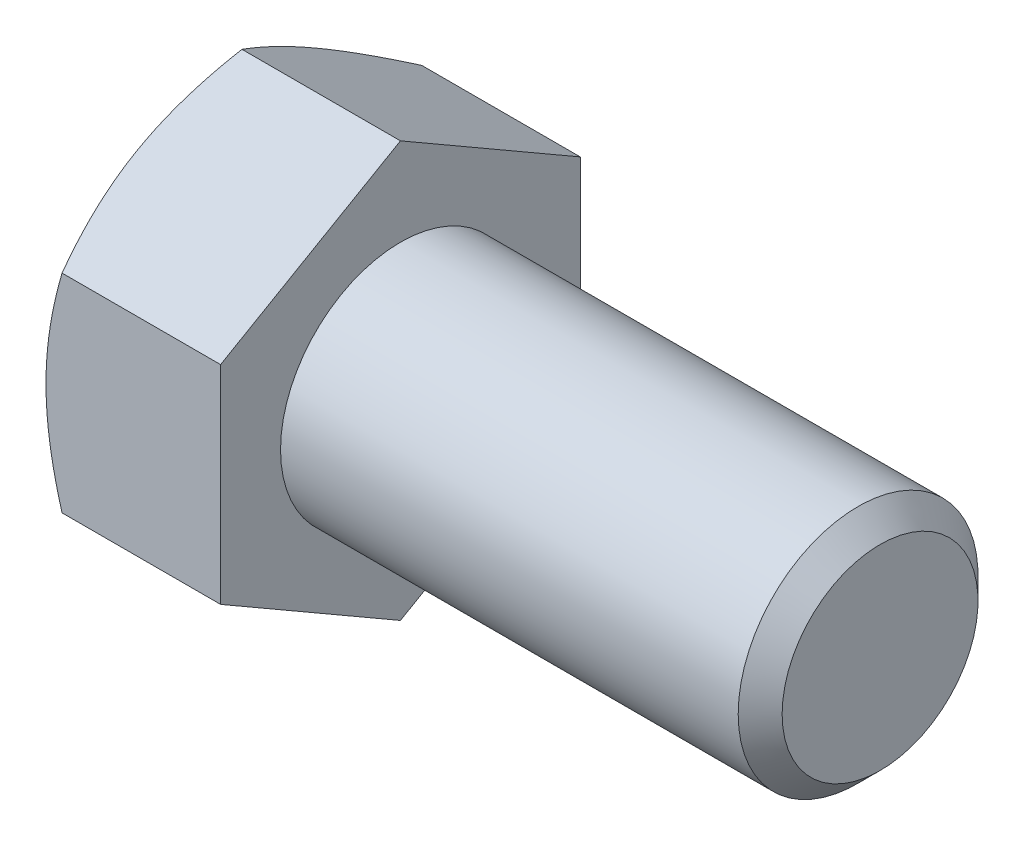
ISO-10303-21;
HEADER;
FILE_DESCRIPTION(('STEP AP214'),'2;1');
FILE_NAME('part.step','',(''),(''),'','','');
FILE_SCHEMA(('AUTOMOTIVE_DESIGN { 1 0 10303 214 1 1 1 1 }'));
ENDSEC;
DATA;
#1=APPLICATION_CONTEXT('core data for automotive mechanical design processes');
#2=APPLICATION_PROTOCOL_DEFINITION('international standard','automotive_design',2000,#1);
#3=PRODUCT_CONTEXT('',#1,'mechanical');
#4=PRODUCT('Part','Part','',(#3));
#5=PRODUCT_RELATED_PRODUCT_CATEGORY('part','',(#4));
#6=PRODUCT_DEFINITION_FORMATION('','',#4);
#7=PRODUCT_DEFINITION_CONTEXT('part definition',#1,'design');
#8=PRODUCT_DEFINITION('design','',#6,#7);
#9=PRODUCT_DEFINITION_SHAPE('','',#8);
#10=(LENGTH_UNIT() NAMED_UNIT(*) SI_UNIT(.MILLI.,.METRE.));
#11=(NAMED_UNIT(*) PLANE_ANGLE_UNIT() SI_UNIT($,.RADIAN.));
#12=(NAMED_UNIT(*) SI_UNIT($,.STERADIAN.) SOLID_ANGLE_UNIT());
#13=UNCERTAINTY_MEASURE_WITH_UNIT(LENGTH_MEASURE(1.E-05),#10,'distance_accuracy_value','');
#14=(GEOMETRIC_REPRESENTATION_CONTEXT(3) GLOBAL_UNCERTAINTY_ASSIGNED_CONTEXT((#13)) GLOBAL_UNIT_ASSIGNED_CONTEXT((#10,
#11,#12)) REPRESENTATION_CONTEXT('',''));
#15=CARTESIAN_POINT('',(0.,0.,0.));
#16=DIRECTION('',(0.,0.,1.));
#17=DIRECTION('',(1.,0.,0.));
#18=AXIS2_PLACEMENT_3D('',#15,#16,#17);
#19=CARTESIAN_POINT('',(9.2456,5.49926131403118,-9.525));
#20=DIRECTION('',(0.,-0.866025403784438,0.5));
#21=DIRECTION('',(0.,-0.5,-0.866025403784438));
#22=AXIS2_PLACEMENT_3D('',#19,#20,#21);
#23=PLANE('',#22);
#24=CARTESIAN_POINT('',(0.850805353685338,10.9986380981162,0.0002));
#25=CARTESIAN_POINT('',(0.781023201247653,10.8777523132173,-0.209180321357812));
#26=CARTESIAN_POINT('',(0.714408233957874,10.7564158029679,-0.419341321922841));
#27=CARTESIAN_POINT('',(0.588391469790024,10.5127697532954,-0.841348659019071));
#28=CARTESIAN_POINT('',(0.528992045309774,10.3904599078574,-1.05319552558363));
#29=CARTESIAN_POINT('',(0.362766604707593,10.0215595864394,-1.69214962520807));
#30=CARTESIAN_POINT('',(0.268218329918823,9.77351282584137,-2.12177921721668));
#31=CARTESIAN_POINT('',(0.15735162884543,9.40232220358294,-2.76470023426138));
#32=CARTESIAN_POINT('',(0.125769866148953,9.28028730086356,-2.97607088606807));
#33=CARTESIAN_POINT('',(0.0728092531292027,9.03565248016183,-3.39979082482396));
#34=CARTESIAN_POINT('',(0.0514305991810305,8.91305255135051,-3.61214013052951));
#35=CARTESIAN_POINT('',(0.0194239766724795,8.66764818787802,-4.03719295646296));
#36=CARTESIAN_POINT('',(0.00878323258549875,8.54484417077186,-4.24989575346439));
#37=CARTESIAN_POINT('',(-0.00152146504907752,8.29912270270345,-4.67549782066928));
#38=CARTESIAN_POINT('',(-0.00118575773535298,8.17620525536319,-4.88839708459929));
#39=CARTESIAN_POINT('',(0.00969884023177671,7.9464080768915,-5.28641747314822));
#40=CARTESIAN_POINT('',(0.0189199445075641,7.83951212670956,-5.4715666899867));
#41=CARTESIAN_POINT('',(0.0454848010115628,7.62597023317657,-5.84143209913029));
#42=CARTESIAN_POINT('',(0.0628291278252528,7.5193243080471,-6.02614825987472));
#43=CARTESIAN_POINT('',(0.126636878025749,7.19979976097279,-6.57958100967286));
#44=CARTESIAN_POINT('',(0.184867121471558,6.98748672019118,-6.94731798341605));
#45=CARTESIAN_POINT('',(0.330443291970776,6.56060850831896,-7.68669273502289));
#46=CARTESIAN_POINT('',(0.418406296346452,6.3460978161353,-8.05823615265175));
#47=CARTESIAN_POINT('',(0.618045797355989,5.92027529884848,-8.79578238759941));
#48=CARTESIAN_POINT('',(0.729675405460148,5.70895802095901,-9.16179464942111));
#49=CARTESIAN_POINT('',(0.85080535368533,5.49914584397734,-9.5252));
#50=B_SPLINE_CURVE_WITH_KNOTS('',3,(#24,#25,#26,#27,#28,#29,#30,#31,#32,#33,#34,#35,#36,#37,#38,
#39,#40,#41,#42,#43,#44,#45,#46,#47,#48,#49),.UNSPECIFIED.,.F.,.F.,(4,2,2,2,2,2,2,2,2,2,2,2,4),
(0.,0.754861746958003,1.50997101692212,3.02340406075151,3.76154608748043,4.49970232035707,
5.23697928598073,5.97423347202914,6.61604550518408,7.25790294292824,8.54252993638602,
9.85564695316764,11.1661863217647),.UNSPECIFIED.);
#51=CARTESIAN_POINT('',(0.850738685968814,10.9985226280624,0.));
#52=VERTEX_POINT('',#51);
#53=CARTESIAN_POINT('',(0.,8.24889197104677,-4.7625));
#54=VERTEX_POINT('',#53);
#55=EDGE_CURVE('E32',#52,#54,#50,.T.);
#56=ORIENTED_EDGE('',*,*,#55,.F.);
#57=DIRECTION('',(-1.,0.,0.));
#58=VECTOR('',#57,1.);
#59=CARTESIAN_POINT('',(9.2456,10.9985226280624,0.));
#60=LINE('',#59,#58);
#61=CARTESIAN_POINT('',(9.2456,10.9985226280624,0.));
#62=VERTEX_POINT('',#61);
#63=EDGE_CURVE('E128',#62,#52,#60,.T.);
#64=ORIENTED_EDGE('',*,*,#63,.F.);
#65=DIRECTION('',(0.,0.5,0.866025403784438));
#66=VECTOR('',#65,1.);
#67=CARTESIAN_POINT('',(9.2456,5.49926131403118,-9.525));
#68=LINE('',#67,#66);
#69=CARTESIAN_POINT('',(9.2456,5.49926131403118,-9.525));
#70=VERTEX_POINT('',#69);
#71=EDGE_CURVE('E213',#70,#62,#68,.T.);
#72=ORIENTED_EDGE('',*,*,#71,.F.);
#73=DIRECTION('',(-1.,0.,0.));
#74=VECTOR('',#73,1.);
#75=CARTESIAN_POINT('',(9.2456,5.49926131403118,-9.525));
#76=LINE('',#75,#74);
#77=CARTESIAN_POINT('',(0.850738685968807,5.49926131403118,-9.525));
#78=VERTEX_POINT('',#77);
#79=EDGE_CURVE('E116',#70,#78,#76,.T.);
#80=ORIENTED_EDGE('',*,*,#79,.T.);
#81=EDGE_CURVE('E110',#54,#78,#50,.T.);
#82=ORIENTED_EDGE('',*,*,#81,.F.);
#83=EDGE_LOOP('',(#56,#64,#72,#80,#82));
#84=FACE_BOUND('',#83,.T.);
#85=ADVANCED_FACE('F16',(#84),#23,.F.);
#86=CARTESIAN_POINT('',(9.2456,10.9985226280624,0.));
#87=DIRECTION('',(0.,-0.866025403784438,-0.5));
#88=DIRECTION('',(0.,0.5,-0.866025403784438));
#89=AXIS2_PLACEMENT_3D('',#86,#87,#88);
#90=PLANE('',#89);
#91=CARTESIAN_POINT('',(0.850805353685331,5.49914584397734,9.5252));
#92=CARTESIAN_POINT('',(0.781023201247651,5.62003162887629,9.31581967864219));
#93=CARTESIAN_POINT('',(0.714408233957875,5.74136813912568,9.10565867807716));
#94=CARTESIAN_POINT('',(0.588391469790027,5.98501418879818,8.68365134098093));
#95=CARTESIAN_POINT('',(0.528992045309778,6.10732403423621,8.47180447441637));
#96=CARTESIAN_POINT('',(0.362766604707597,6.47622435565419,7.83285037479193));
#97=CARTESIAN_POINT('',(0.268218329918826,6.72427111625219,7.40322078278333));
#98=CARTESIAN_POINT('',(0.157351628845434,7.09546173851062,6.76029976573862));
#99=CARTESIAN_POINT('',(0.125769866148958,7.21749664123,6.54892911393194));
#100=CARTESIAN_POINT('',(0.0728092531292075,7.46213146193172,6.12520917517604));
#101=CARTESIAN_POINT('',(0.0514305991810352,7.58473139074305,5.91285986947049));
#102=CARTESIAN_POINT('',(0.0194239766724854,7.83013575421554,5.48780704353704));
#103=CARTESIAN_POINT('',(0.00878323258550612,7.9529397713217,5.27510424653562));
#104=CARTESIAN_POINT('',(-0.00152146504907289,8.1986612393901,4.84950217933073));
#105=CARTESIAN_POINT('',(-0.00118575773535251,8.32157868673037,4.63660291540072));
#106=CARTESIAN_POINT('',(0.00969884023177773,8.55137586520205,4.23858252685179));
#107=CARTESIAN_POINT('',(0.0189199445075688,8.658271815384,4.05343331001331));
#108=CARTESIAN_POINT('',(0.0454848010115698,8.87181370891698,3.68356790086972));
#109=CARTESIAN_POINT('',(0.0628291278252584,8.97845963404645,3.49885174012529));
#110=CARTESIAN_POINT('',(0.126636878025752,9.29798418112076,2.94541899032714));
#111=CARTESIAN_POINT('',(0.184867121471563,9.51029722190237,2.57768201658396));
#112=CARTESIAN_POINT('',(0.330443291970782,9.93717543377459,1.83830726497712));
#113=CARTESIAN_POINT('',(0.418406296346458,10.1516861259583,1.46676384734825));
#114=CARTESIAN_POINT('',(0.618045797355995,10.5775086432451,0.729217612400589));
#115=CARTESIAN_POINT('',(0.729675405460155,10.7888259211345,0.363205350578887));
#116=CARTESIAN_POINT('',(0.850805353685338,10.9986380981162,-0.000199999999998291));
#117=B_SPLINE_CURVE_WITH_KNOTS('',3,(#91,#92,#93,#94,#95,#96,#97,#98,#99,#100,#101,#102,#103,
#104,#105,#106,#107,#108,#109,#110,#111,#112,#113,#114,#115,#116),.UNSPECIFIED.,.F.,.F.,(4,2,2,
2,2,2,2,2,2,2,2,2,4),(0.,0.754861746958003,1.50997101692211,3.0234040607515,3.76154608748042,
4.49970232035706,5.23697928598071,5.97423347202912,6.61604550518407,7.25790294292823,
8.54252993638601,9.85564695316763,11.1661863217647),.UNSPECIFIED.);
#118=CARTESIAN_POINT('',(0.850738685968807,5.49926131403118,9.525));
#119=VERTEX_POINT('',#118);
#120=CARTESIAN_POINT('',(0.,8.24889197104677,4.7625));
#121=VERTEX_POINT('',#120);
#122=EDGE_CURVE('E39',#119,#121,#117,.T.);
#123=ORIENTED_EDGE('',*,*,#122,.F.);
#124=DIRECTION('',(-1.,0.,0.));
#125=VECTOR('',#124,1.);
#126=CARTESIAN_POINT('',(9.2456,5.49926131403118,9.525));
#127=LINE('',#126,#125);
#128=CARTESIAN_POINT('',(9.2456,5.49926131403118,9.525));
#129=VERTEX_POINT('',#128);
#130=EDGE_CURVE('E126',#129,#119,#127,.T.);
#131=ORIENTED_EDGE('',*,*,#130,.F.);
#132=DIRECTION('',(0.,-0.5,0.866025403784438));
#133=VECTOR('',#132,1.);
#134=CARTESIAN_POINT('',(9.2456,10.9985226280624,0.));
#135=LINE('',#134,#133);
#136=EDGE_CURVE('E211',#62,#129,#135,.T.);
#137=ORIENTED_EDGE('',*,*,#136,.F.);
#138=ORIENTED_EDGE('',*,*,#63,.T.);
#139=EDGE_CURVE('E143',#121,#52,#117,.T.);
#140=ORIENTED_EDGE('',*,*,#139,.F.);
#141=EDGE_LOOP('',(#123,#131,#137,#138,#140));
#142=FACE_BOUND('',#141,.T.);
#143=ADVANCED_FACE('F149',(#142),#90,.F.);
#144=CARTESIAN_POINT('',(9.2456,5.49926131403118,9.525));
#145=DIRECTION('',(0.,0.,-1.));
#146=DIRECTION('',(-1.,0.,0.));
#147=AXIS2_PLACEMENT_3D('',#144,#145,#146);
#148=PLANE('',#147);
#149=CARTESIAN_POINT('',(4.65297862020098,-14.7810115366526,9.525));
#150=CARTESIAN_POINT('',(4.55200114697973,-14.5729402848548,9.525));
#151=CARTESIAN_POINT('',(4.45152657852498,-14.3646250845142,9.525));
#152=CARTESIAN_POINT('',(4.25169715270383,-13.9474558848885,9.525));
#153=CARTESIAN_POINT('',(4.15234230655457,-13.7386018802315,9.525));
#154=CARTESIAN_POINT('',(3.85610205085235,-13.1110997604408,9.525));
#155=CARTESIAN_POINT('',(3.6610708294632,-12.6915729928092,9.525));
#156=CARTESIAN_POINT('',(3.27608312845874,-11.8474364819289,9.525));
#157=CARTESIAN_POINT('',(3.0861599652033,-11.422811507093,9.525));
#158=CARTESIAN_POINT('',(2.71407238167632,-10.5701875182868,9.525));
#159=CARTESIAN_POINT('',(2.53190759510787,-10.1421886647408,9.525));
#160=CARTESIAN_POINT('',(2.17173180421228,-9.26840827793759,9.525));
#161=CARTESIAN_POINT('',(1.99403865760541,-8.82249500065036,9.525));
#162=CARTESIAN_POINT('',(1.65207801715252,-7.92545654404826,9.525));
#163=CARTESIAN_POINT('',(1.48781202814776,-7.47433078699664,9.525));
#164=CARTESIAN_POINT('',(1.17701101312694,-6.56698486643259,9.525));
#165=CARTESIAN_POINT('',(1.03044020737989,-6.11077709183231,9.525));
#166=CARTESIAN_POINT('',(0.75972398046239,-5.19183461770943,9.525));
#167=CARTESIAN_POINT('',(0.635571508908759,-4.72910201971932,9.525));
#168=CARTESIAN_POINT('',(0.416296039044819,-3.79927533749822,9.525));
#169=CARTESIAN_POINT('',(0.321019170056992,-3.33221854628566,9.525));
#170=CARTESIAN_POINT('',(0.203895327456017,-2.62737339603031,9.525));
#171=CARTESIAN_POINT('',(0.169151073901591,-2.3916981506508,9.525));
#172=CARTESIAN_POINT('',(0.108940898325766,-1.9191730535318,9.525));
#173=CARTESIAN_POINT('',(0.0834740799106693,-1.68232331751523,9.525));
#174=CARTESIAN_POINT('',(0.0426462139382896,-1.21086692666169,9.525));
#175=CARTESIAN_POINT('',(0.0271575476697075,-0.976271367216066,9.525));
#176=CARTESIAN_POINT('',(0.00611497588533384,-0.50663550847792,9.525));
#177=CARTESIAN_POINT('',(0.000560905150695089,-0.271595216646667,9.525));
#178=CARTESIAN_POINT('',(-0.00047996713179102,0.198511625361359,9.525));
#179=CARTESIAN_POINT('',(0.00403333600034632,0.433578175785753,9.525));
#180=CARTESIAN_POINT('',(0.0230169602197971,0.903311845567794,9.525));
#181=CARTESIAN_POINT('',(0.0374877771856497,1.13797894444952,9.525));
#182=CARTESIAN_POINT('',(0.0838926002328727,1.70156520102244,9.525));
#183=CARTESIAN_POINT('',(0.120529196491433,2.03010533257165,9.525));
#184=CARTESIAN_POINT('',(0.211324091565233,2.68473880457709,9.525));
#185=CARTESIAN_POINT('',(0.265484757377362,3.01083180840532,9.525));
#186=CARTESIAN_POINT('',(0.451380100896858,3.98506326209965,9.525));
#187=CARTESIAN_POINT('',(0.606495020219109,4.62879899939557,9.525));
#188=CARTESIAN_POINT('',(0.875429330956885,5.59158230732317,9.525));
#189=CARTESIAN_POINT('',(0.97240525405904,5.91562142468822,9.525));
#190=CARTESIAN_POINT('',(1.17640873934351,6.56055109397586,9.525));
#191=CARTESIAN_POINT('',(1.28343637307409,6.88144162346878,9.525));
#192=CARTESIAN_POINT('',(1.50582732440543,7.52017825999877,9.525));
#193=CARTESIAN_POINT('',(1.62118794476216,7.8380253147631,9.525));
#194=CARTESIAN_POINT('',(1.85888923263681,8.47108431720183,9.525));
#195=CARTESIAN_POINT('',(1.98122977973554,8.78629631022937,9.525));
#196=CARTESIAN_POINT('',(2.3006347745931,9.58716274310344,9.525));
#197=CARTESIAN_POINT('',(2.50178184900061,10.0711868007297,9.525));
#198=CARTESIAN_POINT('',(2.91473175900995,11.0346830906918,9.525));
#199=CARTESIAN_POINT('',(3.12653548923493,11.514154936841,9.525));
#200=CARTESIAN_POINT('',(3.55844219486129,12.4695072075479,9.525));
#201=CARTESIAN_POINT('',(3.77854763045355,12.9453865165195,9.525));
#202=CARTESIAN_POINT('',(4.22520690131801,13.8940827737157,9.525));
#203=CARTESIAN_POINT('',(4.45176054207864,14.3668998137873,9.525));
#204=CARTESIAN_POINT('',(4.91030379081789,15.31066754278,9.525));
#205=CARTESIAN_POINT('',(5.14230026383007,15.7816148898186,9.525));
#206=CARTESIAN_POINT('',(5.61043419198852,16.7214473380242,9.525));
#207=CARTESIAN_POINT('',(5.84657167244609,17.190332426564,9.525));
#208=CARTESIAN_POINT('',(6.32217781208355,18.1263065899709,9.525));
#209=CARTESIAN_POINT('',(6.56164589066585,18.5933959601917,9.525));
#210=CARTESIAN_POINT('',(7.04336394052912,19.5261387749102,9.525));
#211=CARTESIAN_POINT('',(7.2856139225859,19.9917922138368,9.525));
#212=CARTESIAN_POINT('',(7.96929589667508,21.2980525732429,9.525));
#213=CARTESIAN_POINT('',(8.41334550528857,22.137289288128,9.525));
#214=CARTESIAN_POINT('',(9.30698696570738,23.81285124024,9.525));
#215=CARTESIAN_POINT('',(9.75657908064913,24.6491763367986,9.525));
#216=CARTESIAN_POINT('',(10.6586387715906,26.3171534675353,9.525));
#217=CARTESIAN_POINT('',(11.1110942984919,27.1488120222569,9.525));
#218=CARTESIAN_POINT('',(11.7921739160347,28.394953533384,9.525));
#219=CARTESIAN_POINT('',(12.0195924712892,28.8100962856008,9.525));
#220=CARTESIAN_POINT('',(12.4751463020887,29.6399876727052,9.525));
#221=CARTESIAN_POINT('',(12.7032815766791,30.0547363081167,9.525));
#222=CARTESIAN_POINT('',(12.9317320980144,30.4693112732241,9.525));
#223=B_SPLINE_CURVE_WITH_KNOTS('',3,(#149,#150,#151,#152,#153,#154,#155,#156,#157,#158,#159,
#160,#161,#162,#163,#164,#165,#166,#167,#168,#169,#170,#171,#172,#173,#174,#175,#176,#177,#178,
#179,#180,#181,#182,#183,#184,#185,#186,#187,#188,#189,#190,#191,#192,#193,#194,#195,#196,#197,
#198,#199,#200,#201,#202,#203,#204,#205,#206,#207,#208,#209,#210,#211,#212,#213,#214,#215,#216,
#217,#218,#219,#220,#221,#222),.UNSPECIFIED.,.F.,.F.,(4,2,2,2,2,2,2,2,2,2,2,2,2,2,2,2,2,2,2,2,2,
2,2,2,2,2,2,2,2,2,2,2,2,2,2,2,4),(0.,0.693836530044209,1.38768000463458,2.77557197297935,
4.17100213114403,5.56636633354267,7.00624082823087,8.44627647542748,9.88334978435084,
11.3199703553044,12.748795200913,13.4633089947651,14.1777537333629,14.882869257303,
15.5879730545998,16.2930841835603,16.9982304291963,17.9894005549206,18.9807046150987,
20.9643780182785,21.979010564481,22.9936503334043,24.0079631400216,25.0222584527869,
26.5945433127102,28.1669603864418,29.7398471611297,31.3126865395143,32.8876294963395,
34.4625820831342,36.0372634785706,37.6119509756548,40.4603369594249,43.3088586981741,
46.1491565485713,47.569213896597,48.9892693539118),.UNSPECIFIED.);
#224=CARTESIAN_POINT('',(0.850738685968804,-5.49926131403117,9.525));
#225=VERTEX_POINT('',#224);
#226=CARTESIAN_POINT('',(0.,0.,9.525));
#227=VERTEX_POINT('',#226);
#228=EDGE_CURVE('E223',#225,#227,#223,.T.);
#229=ORIENTED_EDGE('',*,*,#228,.F.);
#230=DIRECTION('',(-1.,0.,0.));
#231=VECTOR('',#230,1.);
#232=CARTESIAN_POINT('',(9.2456,-5.49926131403117,9.525));
#233=LINE('',#232,#231);
#234=CARTESIAN_POINT('',(9.2456,-5.49926131403117,9.525));
#235=VERTEX_POINT('',#234);
#236=EDGE_CURVE('E118',#235,#225,#233,.T.);
#237=ORIENTED_EDGE('',*,*,#236,.F.);
#238=DIRECTION('',(0.,-1.,0.));
#239=VECTOR('',#238,1.);
#240=CARTESIAN_POINT('',(9.2456,5.49926131403118,9.525));
#241=LINE('',#240,#239);
#242=EDGE_CURVE('E207',#129,#235,#241,.T.);
#243=ORIENTED_EDGE('',*,*,#242,.F.);
#244=ORIENTED_EDGE('',*,*,#130,.T.);
#245=EDGE_CURVE('E165',#227,#119,#223,.T.);
#246=ORIENTED_EDGE('',*,*,#245,.F.);
#247=EDGE_LOOP('',(#229,#237,#243,#244,#246));
#248=FACE_BOUND('',#247,.T.);
#249=ADVANCED_FACE('F229',(#248),#148,.F.);
#250=CARTESIAN_POINT('',(9.2456,-10.9985226280624,0.));
#251=DIRECTION('',(0.,0.866025403784438,-0.5));
#252=DIRECTION('',(0.,0.5,0.866025403784438));
#253=AXIS2_PLACEMENT_3D('',#250,#251,#252);
#254=PLANE('',#253);
#255=CARTESIAN_POINT('',(0.85080535368534,-10.9986380981162,-0.000200000000000067));
#256=CARTESIAN_POINT('',(0.781023201247656,-10.8777523132173,0.209180321357816));
#257=CARTESIAN_POINT('',(0.714408233957879,-10.7564158029679,0.419341321922846));
#258=CARTESIAN_POINT('',(0.588391469790028,-10.5127697532954,0.841348659019076));
#259=CARTESIAN_POINT('',(0.528992045309778,-10.3904599078574,1.05319552558363));
#260=CARTESIAN_POINT('',(0.362766604707597,-10.0215595864394,1.69214962520808));
#261=CARTESIAN_POINT('',(0.268218329918828,-9.77351282584137,2.12177921721668));
#262=CARTESIAN_POINT('',(0.157351628845435,-9.40232220358295,2.76470023426139));
#263=CARTESIAN_POINT('',(0.125769866148958,-9.28028730086357,2.97607088606807));
#264=CARTESIAN_POINT('',(0.0728092531292075,-9.03565248016184,3.39979082482397));
#265=CARTESIAN_POINT('',(0.0514305991810347,-8.91305255135051,3.61214013052952));
#266=CARTESIAN_POINT('',(0.0194239766724846,-8.66764818787802,4.03719295646297));
#267=CARTESIAN_POINT('',(0.00878323258550548,-8.54484417077187,4.24989575346439));
#268=CARTESIAN_POINT('',(-0.00152146504907424,-8.29912270270346,4.67549782066929));
#269=CARTESIAN_POINT('',(-0.00118575773535478,-8.17620525536319,4.88839708459929));
#270=CARTESIAN_POINT('',(0.00969884023177595,-7.9464080768915,5.28641747314822));
#271=CARTESIAN_POINT('',(0.0189199445075681,-7.83951212670956,5.4715666899867));
#272=CARTESIAN_POINT('',(0.0454848010115702,-7.62597023317658,5.84143209913029));
#273=CARTESIAN_POINT('',(0.0628291278252588,-7.51932430804711,6.02614825987473));
#274=CARTESIAN_POINT('',(0.126636878025752,-7.19979976097279,6.57958100967287));
#275=CARTESIAN_POINT('',(0.184867121471563,-6.98748672019119,6.94731798341605));
#276=CARTESIAN_POINT('',(0.330443291970782,-6.56060850831897,7.6866927350229));
#277=CARTESIAN_POINT('',(0.418406296346458,-6.34609781613531,8.05823615265176));
#278=CARTESIAN_POINT('',(0.618045797355994,-5.92027529884848,8.79578238759942));
#279=CARTESIAN_POINT('',(0.729675405460152,-5.70895802095901,9.16179464942112));
#280=CARTESIAN_POINT('',(0.85080535368533,-5.49914584397733,9.5252));
#281=B_SPLINE_CURVE_WITH_KNOTS('',3,(#255,#256,#257,#258,#259,#260,#261,#262,#263,#264,#265,
#266,#267,#268,#269,#270,#271,#272,#273,#274,#275,#276,#277,#278,#279,#280),.UNSPECIFIED.,.F.,
.F.,(4,2,2,2,2,2,2,2,2,2,2,2,4),(0.,0.754861746958003,1.50997101692212,3.02340406075151,
3.76154608748043,4.49970232035707,5.23697928598072,5.97423347202913,6.61604550518408,
7.25790294292824,8.54252993638602,9.85564695316764,11.1661863217647),.UNSPECIFIED.);
#282=CARTESIAN_POINT('',(0.850738685968816,-10.9985226280624,0.));
#283=VERTEX_POINT('',#282);
#284=CARTESIAN_POINT('',(0.,-8.24889197104677,4.7625));
#285=VERTEX_POINT('',#284);
#286=EDGE_CURVE('E151',#283,#285,#281,.T.);
#287=ORIENTED_EDGE('',*,*,#286,.F.);
#288=DIRECTION('',(-1.,0.,0.));
#289=VECTOR('',#288,1.);
#290=CARTESIAN_POINT('',(9.2456,-10.9985226280624,0.));
#291=LINE('',#290,#289);
#292=CARTESIAN_POINT('',(9.2456,-10.9985226280624,0.));
#293=VERTEX_POINT('',#292);
#294=EDGE_CURVE('E115',#293,#283,#291,.T.);
#295=ORIENTED_EDGE('',*,*,#294,.F.);
#296=DIRECTION('',(0.,-0.5,-0.866025403784438));
#297=VECTOR('',#296,1.);
#298=CARTESIAN_POINT('',(9.2456,-10.9985226280624,0.));
#299=LINE('',#298,#297);
#300=EDGE_CURVE('E205',#235,#293,#299,.T.);
#301=ORIENTED_EDGE('',*,*,#300,.F.);
#302=ORIENTED_EDGE('',*,*,#236,.T.);
#303=EDGE_CURVE('E153',#285,#225,#281,.T.);
#304=ORIENTED_EDGE('',*,*,#303,.F.);
#305=EDGE_LOOP('',(#287,#295,#301,#302,#304));
#306=FACE_BOUND('',#305,.T.);
#307=ADVANCED_FACE('F201',(#306),#254,.F.);
#308=CARTESIAN_POINT('',(9.2456,-5.4992613140312,-9.525));
#309=DIRECTION('',(0.,0.866025403784439,0.5));
#310=DIRECTION('',(0.,-0.5,0.866025403784439));
#311=AXIS2_PLACEMENT_3D('',#308,#309,#310);
#312=PLANE('',#311);
#313=CARTESIAN_POINT('',(0.850805353685337,-5.49914584397736,-9.5252));
#314=CARTESIAN_POINT('',(0.781023201247655,-5.62003162887631,-9.31581967864218));
#315=CARTESIAN_POINT('',(0.714408233957878,-5.74136813912569,-9.10565867807715));
#316=CARTESIAN_POINT('',(0.588391469790028,-5.9850141887982,-8.68365134098092));
#317=CARTESIAN_POINT('',(0.528992045309778,-6.10732403423622,-8.47180447441636));
#318=CARTESIAN_POINT('',(0.362766604707597,-6.47622435565421,-7.83285037479192));
#319=CARTESIAN_POINT('',(0.268218329918828,-6.7242711162522,-7.40322078278332));
#320=CARTESIAN_POINT('',(0.157351628845436,-7.09546173851063,-6.76029976573861));
#321=CARTESIAN_POINT('',(0.12576986614896,-7.21749664123001,-6.54892911393193));
#322=CARTESIAN_POINT('',(0.0728092531292099,-7.46213146193174,-6.12520917517603));
#323=CARTESIAN_POINT('',(0.051430599181038,-7.58473139074307,-5.91285986947048));
#324=CARTESIAN_POINT('',(0.0194239766724879,-7.83013575421555,-5.48780704353703));
#325=CARTESIAN_POINT('',(0.00878323258550788,-7.95293977132171,-5.27510424653561));
#326=CARTESIAN_POINT('',(-0.00152146504906965,-8.19866123939012,-4.84950217933072));
#327=CARTESIAN_POINT('',(-0.00118575773534702,-8.32157868673039,-4.63660291540071));
#328=CARTESIAN_POINT('',(0.00969884023178369,-8.55137586520207,-4.23858252685178));
#329=CARTESIAN_POINT('',(0.0189199445075734,-8.65827181538401,-4.0534333100133));
#330=CARTESIAN_POINT('',(0.0454848010115735,-8.87181370891699,-3.68356790086971));
#331=CARTESIAN_POINT('',(0.0628291278252626,-8.97845963404647,-3.49885174012527));
#332=CARTESIAN_POINT('',(0.126636878025757,-9.29798418112078,-2.94541899032714));
#333=CARTESIAN_POINT('',(0.184867121471567,-9.51029722190238,-2.57768201658395));
#334=CARTESIAN_POINT('',(0.330443291970785,-9.9371754337746,-1.83830726497711));
#335=CARTESIAN_POINT('',(0.418406296346461,-10.1516861259583,-1.46676384734824));
#336=CARTESIAN_POINT('',(0.618045797355998,-10.5775086432451,-0.729217612400585));
#337=CARTESIAN_POINT('',(0.729675405460158,-10.7888259211346,-0.363205350578885));
#338=CARTESIAN_POINT('',(0.85080535368534,-10.9986380981162,0.000200000000000827));
#339=B_SPLINE_CURVE_WITH_KNOTS('',3,(#313,#314,#315,#316,#317,#318,#319,#320,#321,#322,#323,
#324,#325,#326,#327,#328,#329,#330,#331,#332,#333,#334,#335,#336,#337,#338),.UNSPECIFIED.,.F.,
.F.,(4,2,2,2,2,2,2,2,2,2,2,2,4),(0.,0.754861746958003,1.50997101692212,3.02340406075151,
3.76154608748042,4.49970232035707,5.23697928598072,5.97423347202913,6.61604550518408,
7.25790294292823,8.54252993638601,9.85564695316763,11.1661863217647),.UNSPECIFIED.);
#340=CARTESIAN_POINT('',(0.850738685968812,-5.4992613140312,-9.525));
#341=VERTEX_POINT('',#340);
#342=CARTESIAN_POINT('',(0.,-8.24889197104678,-4.7625));
#343=VERTEX_POINT('',#342);
#344=EDGE_CURVE('E92',#341,#343,#339,.T.);
#345=ORIENTED_EDGE('',*,*,#344,.F.);
#346=DIRECTION('',(-1.,0.,0.));
#347=VECTOR('',#346,1.);
#348=CARTESIAN_POINT('',(9.2456,-5.4992613140312,-9.525));
#349=LINE('',#348,#347);
#350=CARTESIAN_POINT('',(9.2456,-5.4992613140312,-9.525));
#351=VERTEX_POINT('',#350);
#352=EDGE_CURVE('E106',#351,#341,#349,.T.);
#353=ORIENTED_EDGE('',*,*,#352,.F.);
#354=DIRECTION('',(0.,0.5,-0.866025403784439));
#355=VECTOR('',#354,1.);
#356=CARTESIAN_POINT('',(9.2456,-5.4992613140312,-9.525));
#357=LINE('',#356,#355);
#358=EDGE_CURVE('E203',#293,#351,#357,.T.);
#359=ORIENTED_EDGE('',*,*,#358,.F.);
#360=ORIENTED_EDGE('',*,*,#294,.T.);
#361=EDGE_CURVE('E109',#343,#283,#339,.T.);
#362=ORIENTED_EDGE('',*,*,#361,.F.);
#363=EDGE_LOOP('',(#345,#353,#359,#360,#362));
#364=FACE_BOUND('',#363,.T.);
#365=ADVANCED_FACE('F104',(#364),#312,.F.);
#366=CARTESIAN_POINT('',(9.2456,5.49926131403118,-9.525));
#367=DIRECTION('',(0.,0.,1.));
#368=DIRECTION('',(1.,0.,0.));
#369=AXIS2_PLACEMENT_3D('',#366,#367,#368);
#370=PLANE('',#369);
#371=CARTESIAN_POINT('',(4.65297862020099,-14.7810115366526,-9.525));
#372=CARTESIAN_POINT('',(4.55200114697973,-14.5729402848548,-9.525));
#373=CARTESIAN_POINT('',(4.45152657852499,-14.3646250845143,-9.525));
#374=CARTESIAN_POINT('',(4.25169715270384,-13.9474558848886,-9.525));
#375=CARTESIAN_POINT('',(4.15234230655458,-13.7386018802315,-9.525));
#376=CARTESIAN_POINT('',(3.85610205085236,-13.1110997604408,-9.525));
#377=CARTESIAN_POINT('',(3.66107082946321,-12.6915729928092,-9.525));
#378=CARTESIAN_POINT('',(3.27608312845875,-11.8474364819289,-9.525));
#379=CARTESIAN_POINT('',(3.08615996520331,-11.4228115070931,-9.525));
#380=CARTESIAN_POINT('',(2.71407238167633,-10.5701875182868,-9.525));
#381=CARTESIAN_POINT('',(2.53190759510787,-10.1421886647409,-9.525));
#382=CARTESIAN_POINT('',(2.17173180421229,-9.26840827793761,-9.525));
#383=CARTESIAN_POINT('',(1.99403865760542,-8.82249500065038,-9.525));
#384=CARTESIAN_POINT('',(1.65207801715253,-7.92545654404828,-9.525));
#385=CARTESIAN_POINT('',(1.48781202814776,-7.47433078699666,-9.525));
#386=CARTESIAN_POINT('',(1.17701101312695,-6.56698486643261,-9.525));
#387=CARTESIAN_POINT('',(1.03044020737989,-6.11077709183233,-9.525));
#388=CARTESIAN_POINT('',(0.759723980462396,-5.19183461770945,-9.525));
#389=CARTESIAN_POINT('',(0.635571508908765,-4.72910201971934,-9.525));
#390=CARTESIAN_POINT('',(0.416296039044825,-3.79927533749824,-9.525));
#391=CARTESIAN_POINT('',(0.321019170056995,-3.33221854628568,-9.525));
#392=CARTESIAN_POINT('',(0.20389532745602,-2.62737339603033,-9.525));
#393=CARTESIAN_POINT('',(0.169151073901594,-2.39169815065082,-9.525));
#394=CARTESIAN_POINT('',(0.108940898325768,-1.91917305353182,-9.525));
#395=CARTESIAN_POINT('',(0.0834740799106709,-1.68232331751525,-9.525));
#396=CARTESIAN_POINT('',(0.04264621393829,-1.21086692666171,-9.525));
#397=CARTESIAN_POINT('',(0.0271575476697077,-0.976271367216086,-9.525));
#398=CARTESIAN_POINT('',(0.00611497588533373,-0.506635508477939,-9.525));
#399=CARTESIAN_POINT('',(0.000560905150694961,-0.271595216646686,-9.525));
#400=CARTESIAN_POINT('',(-0.000479967131790892,0.19851162536134,-9.525));
#401=CARTESIAN_POINT('',(0.00403333600034672,0.433578175785733,-9.525));
#402=CARTESIAN_POINT('',(0.0230169602197967,0.903311845567775,-9.525));
#403=CARTESIAN_POINT('',(0.0374877771856483,1.1379789444495,-9.525));
#404=CARTESIAN_POINT('',(0.0838926002328698,1.70156520102242,-9.525));
#405=CARTESIAN_POINT('',(0.12052919649143,2.03010533257162,-9.525));
#406=CARTESIAN_POINT('',(0.21132409156523,2.68473880457707,-9.525));
#407=CARTESIAN_POINT('',(0.265484757377358,3.01083180840529,-9.525));
#408=CARTESIAN_POINT('',(0.451380100896853,3.98506326209962,-9.525));
#409=CARTESIAN_POINT('',(0.606495020219103,4.62879899939554,-9.525));
#410=CARTESIAN_POINT('',(0.875429330956877,5.59158230732314,-9.525));
#411=CARTESIAN_POINT('',(0.972405254059032,5.9156214246882,-9.525));
#412=CARTESIAN_POINT('',(1.1764087393435,6.56055109397584,-9.525));
#413=CARTESIAN_POINT('',(1.28343637307408,6.88144162346875,-9.525));
#414=CARTESIAN_POINT('',(1.50582732440542,7.52017825999875,-9.525));
#415=CARTESIAN_POINT('',(1.62118794476215,7.83802531476308,-9.525));
#416=CARTESIAN_POINT('',(1.8588892326368,8.4710843172018,-9.525));
#417=CARTESIAN_POINT('',(1.98122977973553,8.78629631022934,-9.525));
#418=CARTESIAN_POINT('',(2.30063477459309,9.58716274310342,-9.525));
#419=CARTESIAN_POINT('',(2.5017818490006,10.0711868007296,-9.525));
#420=CARTESIAN_POINT('',(2.91473175900994,11.0346830906918,-9.525));
#421=CARTESIAN_POINT('',(3.12653548923492,11.514154936841,-9.525));
#422=CARTESIAN_POINT('',(3.55844219486128,12.4695072075479,-9.525));
#423=CARTESIAN_POINT('',(3.77854763045354,12.9453865165195,-9.525));
#424=CARTESIAN_POINT('',(4.225206901318,13.8940827737157,-9.525));
#425=CARTESIAN_POINT('',(4.45176054207863,14.3668998137873,-9.525));
#426=CARTESIAN_POINT('',(4.91030379081788,15.31066754278,-9.525));
#427=CARTESIAN_POINT('',(5.14230026383007,15.7816148898186,-9.525));
#428=CARTESIAN_POINT('',(5.61043419198851,16.7214473380242,-9.525));
#429=CARTESIAN_POINT('',(5.84657167244608,17.190332426564,-9.525));
#430=CARTESIAN_POINT('',(6.32217781208355,18.1263065899709,-9.525));
#431=CARTESIAN_POINT('',(6.56164589066585,18.5933959601917,-9.525));
#432=CARTESIAN_POINT('',(7.04336394052912,19.5261387749102,-9.525));
#433=CARTESIAN_POINT('',(7.2856139225859,19.9917922138368,-9.525));
#434=CARTESIAN_POINT('',(7.96929589667508,21.2980525732429,-9.525));
#435=CARTESIAN_POINT('',(8.41334550528857,22.137289288128,-9.525));
#436=CARTESIAN_POINT('',(9.30698696570739,23.81285124024,-9.525));
#437=CARTESIAN_POINT('',(9.75657908064913,24.6491763367986,-9.525));
#438=CARTESIAN_POINT('',(10.6586387715906,26.3171534675353,-9.525));
#439=CARTESIAN_POINT('',(11.1110942984919,27.1488120222569,-9.525));
#440=CARTESIAN_POINT('',(11.7921739160347,28.394953533384,-9.525));
#441=CARTESIAN_POINT('',(12.0195924712892,28.8100962856008,-9.525));
#442=CARTESIAN_POINT('',(12.4751463020887,29.6399876727052,-9.525));
#443=CARTESIAN_POINT('',(12.7032815766791,30.0547363081167,-9.525));
#444=CARTESIAN_POINT('',(12.9317320980144,30.4693112732241,-9.525));
#445=B_SPLINE_CURVE_WITH_KNOTS('',3,(#371,#372,#373,#374,#375,#376,#377,#378,#379,#380,#381,
#382,#383,#384,#385,#386,#387,#388,#389,#390,#391,#392,#393,#394,#395,#396,#397,#398,#399,#400,
#401,#402,#403,#404,#405,#406,#407,#408,#409,#410,#411,#412,#413,#414,#415,#416,#417,#418,#419,
#420,#421,#422,#423,#424,#425,#426,#427,#428,#429,#430,#431,#432,#433,#434,#435,#436,#437,#438,
#439,#440,#441,#442,#443,#444),.UNSPECIFIED.,.F.,.F.,(4,2,2,2,2,2,2,2,2,2,2,2,2,2,2,2,2,2,2,2,2,
2,2,2,2,2,2,2,2,2,2,2,2,2,2,2,4),(0.,0.693836530044208,1.38768000463458,2.77557197297935,
4.17100213114403,5.56636633354268,7.00624082823087,8.44627647542748,9.88334978435085,
11.3199703553044,12.748795200913,13.4633089947651,14.1777537333629,14.882869257303,
15.5879730545998,16.2930841835603,16.9982304291964,17.9894005549206,18.9807046150987,
20.9643780182785,21.979010564481,22.9936503334043,24.0079631400216,25.0222584527869,
26.5945433127102,28.1669603864418,29.7398471611297,31.3126865395143,32.8876294963395,
34.4625820831342,36.0372634785706,37.6119509756548,40.4603369594249,43.3088586981742,
46.1491565485713,47.569213896597,48.9892693539118),.UNSPECIFIED.);
#446=CARTESIAN_POINT('',(0.,0.,-9.525));
#447=VERTEX_POINT('',#446);
#448=EDGE_CURVE('E98',#78,#447,#445,.F.);
#449=ORIENTED_EDGE('',*,*,#448,.F.);
#450=ORIENTED_EDGE('',*,*,#79,.F.);
#451=DIRECTION('',(0.,1.,0.));
#452=VECTOR('',#451,1.);
#453=CARTESIAN_POINT('',(9.2456,5.49926131403118,-9.525));
#454=LINE('',#453,#452);
#455=EDGE_CURVE('E114',#351,#70,#454,.T.);
#456=ORIENTED_EDGE('',*,*,#455,.F.);
#457=ORIENTED_EDGE('',*,*,#352,.T.);
#458=EDGE_CURVE('E89',#447,#341,#445,.F.);
#459=ORIENTED_EDGE('',*,*,#458,.F.);
#460=EDGE_LOOP('',(#449,#450,#456,#457,#459));
#461=FACE_BOUND('',#460,.T.);
#462=ADVANCED_FACE('F112',(#461),#370,.F.);
#463=CARTESIAN_POINT('',(9.2456,10.9985226280624,0.));
#464=DIRECTION('',(1.,0.,0.));
#465=DIRECTION('',(0.,0.,-1.));
#466=AXIS2_PLACEMENT_3D('',#463,#464,#465);
#467=PLANE('',#466);
#468=ORIENTED_EDGE('',*,*,#71,.T.);
#469=ORIENTED_EDGE('',*,*,#136,.T.);
#470=ORIENTED_EDGE('',*,*,#242,.T.);
#471=ORIENTED_EDGE('',*,*,#300,.T.);
#472=ORIENTED_EDGE('',*,*,#358,.T.);
#473=ORIENTED_EDGE('',*,*,#455,.T.);
#474=EDGE_LOOP('',(#468,#469,#470,#471,#472,#473));
#475=FACE_BOUND('',#474,.T.);
#476=CARTESIAN_POINT('',(9.2456,0.,0.));
#477=DIRECTION('',(1.,0.,0.));
#478=DIRECTION('',(0.,0.,-1.));
#479=AXIS2_PLACEMENT_3D('',#476,#477,#478);
#480=CIRCLE('',#479,6.35);
#481=CARTESIAN_POINT('',(9.2456,0.,-6.35));
#482=VERTEX_POINT('',#481);
#483=EDGE_CURVE('E216',#482,#482,#480,.F.);
#484=ORIENTED_EDGE('',*,*,#483,.T.);
#485=EDGE_LOOP('',(#484));
#486=FACE_BOUND('',#485,.T.);
#487=ADVANCED_FACE('F231',(#475,#486),#467,.T.);
#488=CARTESIAN_POINT('',(0.,0.,0.));
#489=DIRECTION('',(-1.,0.,0.));
#490=DIRECTION('',(0.,0.,1.));
#491=AXIS2_PLACEMENT_3D('',#488,#489,#490);
#492=CYLINDRICAL_SURFACE('',#491,6.35);
#493=ORIENTED_EDGE('',*,*,#483,.F.);
#494=EDGE_LOOP('',(#493));
#495=FACE_BOUND('',#494,.T.);
#496=CARTESIAN_POINT('',(33.48228,0.,0.));
#497=DIRECTION('',(-1.,0.,0.));
#498=DIRECTION('',(0.,0.,1.));
#499=AXIS2_PLACEMENT_3D('',#496,#497,#498);
#500=CIRCLE('',#499,6.35);
#501=CARTESIAN_POINT('',(33.48228,0.,6.35));
#502=VERTEX_POINT('',#501);
#503=EDGE_CURVE('E219',#502,#502,#500,.T.);
#504=ORIENTED_EDGE('',*,*,#503,.T.);
#505=EDGE_LOOP('',(#504));
#506=FACE_BOUND('',#505,.T.);
#507=ADVANCED_FACE('F268',(#495,#506),#492,.T.);
#508=CARTESIAN_POINT('',(34.6456,0.,0.));
#509=DIRECTION('',(-1.,0.,0.));
#510=DIRECTION('',(0.,0.,1.));
#511=AXIS2_PLACEMENT_3D('',#508,#509,#510);
#512=CONICAL_SURFACE('',#511,5.18668,0.785398163397443);
#513=ORIENTED_EDGE('',*,*,#503,.F.);
#514=EDGE_LOOP('',(#513));
#515=FACE_BOUND('',#514,.T.);
#516=CARTESIAN_POINT('',(34.6456,0.,0.));
#517=DIRECTION('',(-1.,0.,0.));
#518=DIRECTION('',(0.,0.,1.));
#519=AXIS2_PLACEMENT_3D('',#516,#517,#518);
#520=CIRCLE('',#519,5.18668);
#521=CARTESIAN_POINT('',(34.6456,0.,5.18668));
#522=VERTEX_POINT('',#521);
#523=EDGE_CURVE('E221',#522,#522,#520,.T.);
#524=ORIENTED_EDGE('',*,*,#523,.T.);
#525=EDGE_LOOP('',(#524));
#526=FACE_BOUND('',#525,.T.);
#527=ADVANCED_FACE('F270',(#515,#526),#512,.T.);
#528=CARTESIAN_POINT('',(34.6456,0.,0.));
#529=DIRECTION('',(-1.,0.,0.));
#530=DIRECTION('',(0.,0.,1.));
#531=AXIS2_PLACEMENT_3D('',#528,#529,#530);
#532=PLANE('',#531);
#533=ORIENTED_EDGE('',*,*,#523,.F.);
#534=EDGE_LOOP('',(#533));
#535=FACE_BOUND('',#534,.T.);
#536=ADVANCED_FACE('F178',(#535),#532,.F.);
#537=CARTESIAN_POINT('',(0.,0.,0.));
#538=DIRECTION('',(1.,0.,0.));
#539=DIRECTION('',(0.,0.,-1.));
#540=AXIS2_PLACEMENT_3D('',#537,#538,#539);
#541=CONICAL_SURFACE('',#540,9.525,1.0471975511966);
#542=ORIENTED_EDGE('',*,*,#344,.T.);
#543=CARTESIAN_POINT('',(0.,0.,0.));
#544=DIRECTION('',(1.,0.,0.));
#545=DIRECTION('',(0.,0.,-1.));
#546=AXIS2_PLACEMENT_3D('',#543,#544,#545);
#547=CIRCLE('',#546,9.525);
#548=EDGE_CURVE('E20',#343,#447,#547,.T.);
#549=ORIENTED_EDGE('',*,*,#548,.T.);
#550=ORIENTED_EDGE('',*,*,#458,.T.);
#551=EDGE_LOOP('',(#542,#549,#550));
#552=FACE_BOUND('',#551,.T.);
#553=ADVANCED_FACE('F91',(#552),#541,.T.);
#554=ORIENTED_EDGE('',*,*,#286,.T.);
#555=EDGE_CURVE('E133',#285,#343,#547,.T.);
#556=ORIENTED_EDGE('',*,*,#555,.T.);
#557=ORIENTED_EDGE('',*,*,#361,.T.);
#558=EDGE_LOOP('',(#554,#556,#557));
#559=FACE_BOUND('',#558,.T.);
#560=ADVANCED_FACE('F177',(#559),#541,.T.);
#561=ORIENTED_EDGE('',*,*,#228,.T.);
#562=EDGE_CURVE('E134',#227,#285,#547,.T.);
#563=ORIENTED_EDGE('',*,*,#562,.T.);
#564=ORIENTED_EDGE('',*,*,#303,.T.);
#565=EDGE_LOOP('',(#561,#563,#564));
#566=FACE_BOUND('',#565,.T.);
#567=ADVANCED_FACE('F172',(#566),#541,.T.);
#568=ORIENTED_EDGE('',*,*,#245,.T.);
#569=ORIENTED_EDGE('',*,*,#122,.T.);
#570=CARTESIAN_POINT('',(0.,0.,0.));
#571=DIRECTION('',(-1.,0.,0.));
#572=DIRECTION('',(0.,0.,1.));
#573=AXIS2_PLACEMENT_3D('',#570,#571,#572);
#574=CIRCLE('',#573,9.525);
#575=EDGE_CURVE('E99',#227,#121,#574,.T.);
#576=ORIENTED_EDGE('',*,*,#575,.F.);
#577=EDGE_LOOP('',(#568,#569,#576));
#578=FACE_BOUND('',#577,.T.);
#579=ADVANCED_FACE('F176',(#578),#541,.T.);
#580=ORIENTED_EDGE('',*,*,#139,.T.);
#581=ORIENTED_EDGE('',*,*,#55,.T.);
#582=EDGE_CURVE('E25',#54,#121,#547,.T.);
#583=ORIENTED_EDGE('',*,*,#582,.T.);
#584=EDGE_LOOP('',(#580,#581,#583));
#585=FACE_BOUND('',#584,.T.);
#586=ADVANCED_FACE('F142',(#585),#541,.T.);
#587=ORIENTED_EDGE('',*,*,#81,.T.);
#588=ORIENTED_EDGE('',*,*,#448,.T.);
#589=EDGE_CURVE('E10',#447,#54,#547,.T.);
#590=ORIENTED_EDGE('',*,*,#589,.T.);
#591=EDGE_LOOP('',(#587,#588,#590));
#592=FACE_BOUND('',#591,.T.);
#593=ADVANCED_FACE('F235',(#592),#541,.T.);
#594=CARTESIAN_POINT('',(0.,10.9985226280624,0.));
#595=DIRECTION('',(1.,0.,0.));
#596=DIRECTION('',(0.,0.,-1.));
#597=AXIS2_PLACEMENT_3D('',#594,#595,#596);
#598=PLANE('',#597);
#599=ORIENTED_EDGE('',*,*,#589,.F.);
#600=ORIENTED_EDGE('',*,*,#548,.F.);
#601=ORIENTED_EDGE('',*,*,#555,.F.);
#602=ORIENTED_EDGE('',*,*,#562,.F.);
#603=ORIENTED_EDGE('',*,*,#575,.T.);
#604=ORIENTED_EDGE('',*,*,#582,.F.);
#605=EDGE_LOOP('',(#599,#600,#601,#602,#603,#604));
#606=FACE_BOUND('',#605,.T.);
#607=ADVANCED_FACE('F146',(#606),#598,.F.);
#608=CLOSED_SHELL('',(#85,#143,#249,#307,#365,#462,#487,#507,#527,#536,#553,#560,#567,#579,#586,
#593,#607));
#609=MANIFOLD_SOLID_BREP('B1',#608);
#610=ADVANCED_BREP_SHAPE_REPRESENTATION('',(#18,#609),#14);
#611=SHAPE_DEFINITION_REPRESENTATION(#9,#610);
ENDSEC;
END-ISO-10303-21;
